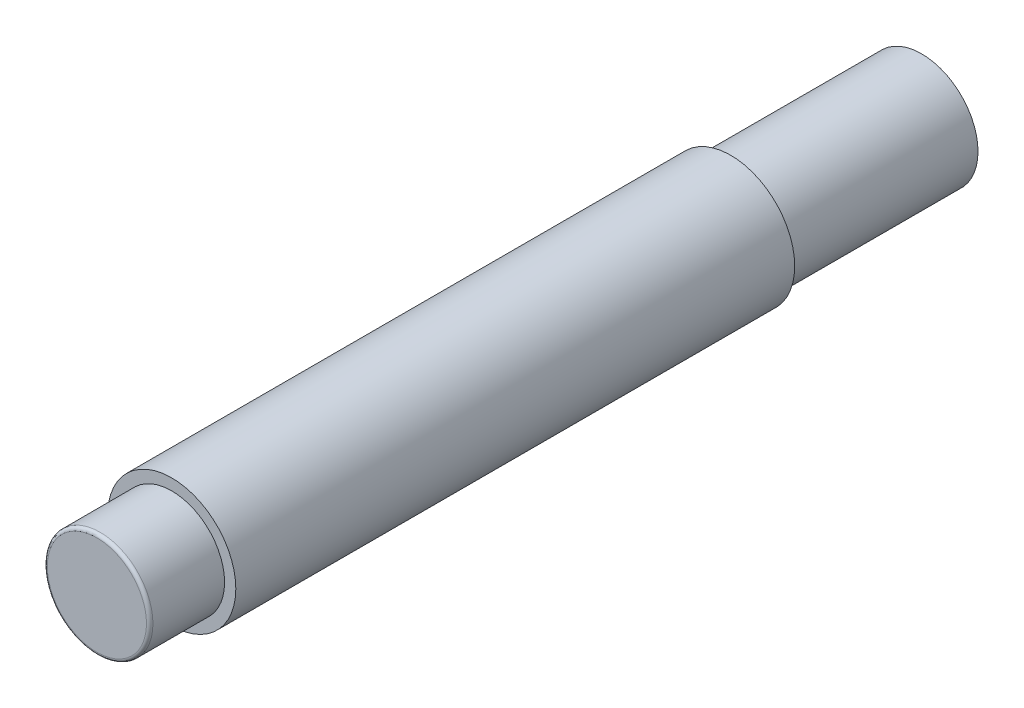
ISO-10303-21;
HEADER;
FILE_DESCRIPTION(('STEP AP214'),'2;1');
FILE_NAME('part.step','',(''),(''),'','','');
FILE_SCHEMA(('AUTOMOTIVE_DESIGN { 1 0 10303 214 1 1 1 1 }'));
ENDSEC;
DATA;
#1=APPLICATION_CONTEXT('core data for automotive mechanical design processes');
#2=APPLICATION_PROTOCOL_DEFINITION('international standard','automotive_design',2000,#1);
#3=PRODUCT_CONTEXT('',#1,'mechanical');
#4=PRODUCT('Part','Part','',(#3));
#5=PRODUCT_RELATED_PRODUCT_CATEGORY('part','',(#4));
#6=PRODUCT_DEFINITION_FORMATION('','',#4);
#7=PRODUCT_DEFINITION_CONTEXT('part definition',#1,'design');
#8=PRODUCT_DEFINITION('design','',#6,#7);
#9=PRODUCT_DEFINITION_SHAPE('','',#8);
#10=(LENGTH_UNIT() NAMED_UNIT(*) SI_UNIT(.MILLI.,.METRE.));
#11=(NAMED_UNIT(*) PLANE_ANGLE_UNIT() SI_UNIT($,.RADIAN.));
#12=(NAMED_UNIT(*) SI_UNIT($,.STERADIAN.) SOLID_ANGLE_UNIT());
#13=UNCERTAINTY_MEASURE_WITH_UNIT(LENGTH_MEASURE(1.E-05),#10,'distance_accuracy_value','');
#14=(GEOMETRIC_REPRESENTATION_CONTEXT(3) GLOBAL_UNCERTAINTY_ASSIGNED_CONTEXT((#13)) GLOBAL_UNIT_ASSIGNED_CONTEXT((#10,
#11,#12)) REPRESENTATION_CONTEXT('',''));
#15=CARTESIAN_POINT('',(0.,0.,0.));
#16=DIRECTION('',(0.,0.,1.));
#17=DIRECTION('',(1.,0.,0.));
#18=AXIS2_PLACEMENT_3D('',#15,#16,#17);
#19=CARTESIAN_POINT('',(0.,0.,0.));
#20=DIRECTION('',(0.,0.,-1.));
#21=DIRECTION('',(-1.,0.,0.));
#22=AXIS2_PLACEMENT_3D('',#19,#20,#21);
#23=PLANE('',#22);
#24=CARTESIAN_POINT('',(0.,0.,0.));
#25=DIRECTION('',(0.,0.,-1.));
#26=DIRECTION('',(-1.,0.,0.));
#27=AXIS2_PLACEMENT_3D('',#24,#25,#26);
#28=CIRCLE('',#27,3.065);
#29=CARTESIAN_POINT('',(-3.065,0.,0.));
#30=VERTEX_POINT('',#29);
#31=EDGE_CURVE('E41',#30,#30,#28,.F.);
#32=ORIENTED_EDGE('',*,*,#31,.T.);
#33=EDGE_LOOP('',(#32));
#34=FACE_BOUND('',#33,.T.);
#35=ADVANCED_FACE('F34',(#34),#23,.F.);
#36=CARTESIAN_POINT('',(0.,0.,22.5914840590574));
#37=DIRECTION('',(0.,0.,1.));
#38=DIRECTION('',(1.,0.,0.));
#39=AXIS2_PLACEMENT_3D('',#36,#37,#38);
#40=CYLINDRICAL_SURFACE('',#39,3.265);
#41=CARTESIAN_POINT('',(0.,0.,-0.199999999999999));
#42=DIRECTION('',(0.,0.,-1.));
#43=DIRECTION('',(-1.,0.,0.));
#44=AXIS2_PLACEMENT_3D('',#41,#42,#43);
#45=CIRCLE('',#44,3.265);
#46=CARTESIAN_POINT('',(-3.265,0.,-0.199999999999999));
#47=VERTEX_POINT('',#46);
#48=EDGE_CURVE('E10',#47,#47,#45,.T.);
#49=ORIENTED_EDGE('',*,*,#48,.T.);
#50=EDGE_LOOP('',(#49));
#51=FACE_BOUND('',#50,.T.);
#52=CARTESIAN_POINT('',(0.,0.,-4.63));
#53=DIRECTION('',(0.,0.,1.));
#54=DIRECTION('',(1.,0.,0.));
#55=AXIS2_PLACEMENT_3D('',#52,#53,#54);
#56=CIRCLE('',#55,3.26499999999999);
#57=CARTESIAN_POINT('',(3.26499999999999,0.,-4.63));
#58=VERTEX_POINT('',#57);
#59=EDGE_CURVE('E45',#58,#58,#56,.T.);
#60=ORIENTED_EDGE('',*,*,#59,.T.);
#61=EDGE_LOOP('',(#60));
#62=FACE_BOUND('',#61,.T.);
#63=ADVANCED_FACE('F78',(#51,#62),#40,.T.);
#64=CARTESIAN_POINT('',(0.,3.26499999999999,-4.63));
#65=DIRECTION('',(0.,0.,-1.));
#66=DIRECTION('',(-1.,0.,0.));
#67=AXIS2_PLACEMENT_3D('',#64,#65,#66);
#68=PLANE('',#67);
#69=ORIENTED_EDGE('',*,*,#59,.F.);
#70=EDGE_LOOP('',(#69));
#71=FACE_BOUND('',#70,.T.);
#72=CARTESIAN_POINT('',(0.,0.,-4.63));
#73=DIRECTION('',(0.,0.,1.));
#74=DIRECTION('',(1.,0.,0.));
#75=AXIS2_PLACEMENT_3D('',#72,#73,#74);
#76=CIRCLE('',#75,3.95999999999999);
#77=CARTESIAN_POINT('',(3.95999999999999,0.,-4.63));
#78=VERTEX_POINT('',#77);
#79=EDGE_CURVE('E49',#78,#78,#76,.T.);
#80=ORIENTED_EDGE('',*,*,#79,.T.);
#81=EDGE_LOOP('',(#80));
#82=FACE_BOUND('',#81,.T.);
#83=ADVANCED_FACE('F82',(#71,#82),#68,.F.);
#84=CARTESIAN_POINT('',(0.,0.,22.5914840590574));
#85=DIRECTION('',(0.,0.,1.));
#86=DIRECTION('',(1.,0.,0.));
#87=AXIS2_PLACEMENT_3D('',#84,#85,#86);
#88=CYLINDRICAL_SURFACE('',#87,3.95999999999999);
#89=ORIENTED_EDGE('',*,*,#79,.F.);
#90=EDGE_LOOP('',(#89));
#91=FACE_BOUND('',#90,.T.);
#92=CARTESIAN_POINT('',(0.,0.,-39.19));
#93=DIRECTION('',(0.,0.,1.));
#94=DIRECTION('',(1.,0.,0.));
#95=AXIS2_PLACEMENT_3D('',#92,#93,#94);
#96=CIRCLE('',#95,3.95999999999999);
#97=CARTESIAN_POINT('',(3.95999999999999,0.,-39.19));
#98=VERTEX_POINT('',#97);
#99=EDGE_CURVE('E54',#98,#98,#96,.T.);
#100=ORIENTED_EDGE('',*,*,#99,.T.);
#101=EDGE_LOOP('',(#100));
#102=FACE_BOUND('',#101,.T.);
#103=ADVANCED_FACE('F87',(#91,#102),#88,.T.);
#104=CARTESIAN_POINT('',(0.,3.95999999999999,-39.19));
#105=DIRECTION('',(0.,0.,1.));
#106=DIRECTION('',(1.,0.,0.));
#107=AXIS2_PLACEMENT_3D('',#104,#105,#106);
#108=PLANE('',#107);
#109=ORIENTED_EDGE('',*,*,#99,.F.);
#110=EDGE_LOOP('',(#109));
#111=FACE_BOUND('',#110,.T.);
#112=CARTESIAN_POINT('',(0.,0.,-39.19));
#113=DIRECTION('',(0.,0.,1.));
#114=DIRECTION('',(1.,0.,0.));
#115=AXIS2_PLACEMENT_3D('',#112,#113,#114);
#116=CIRCLE('',#115,3.485);
#117=CARTESIAN_POINT('',(3.485,0.,-39.19));
#118=VERTEX_POINT('',#117);
#119=EDGE_CURVE('E57',#118,#118,#116,.T.);
#120=ORIENTED_EDGE('',*,*,#119,.T.);
#121=EDGE_LOOP('',(#120));
#122=FACE_BOUND('',#121,.T.);
#123=ADVANCED_FACE('F74',(#111,#122),#108,.F.);
#124=CARTESIAN_POINT('',(0.,0.,22.5914840590574));
#125=DIRECTION('',(0.,0.,1.));
#126=DIRECTION('',(1.,0.,0.));
#127=AXIS2_PLACEMENT_3D('',#124,#125,#126);
#128=CYLINDRICAL_SURFACE('',#127,3.485);
#129=ORIENTED_EDGE('',*,*,#119,.F.);
#130=EDGE_LOOP('',(#129));
#131=FACE_BOUND('',#130,.T.);
#132=CARTESIAN_POINT('',(0.,0.,-51.));
#133=DIRECTION('',(0.,0.,1.));
#134=DIRECTION('',(1.,0.,0.));
#135=AXIS2_PLACEMENT_3D('',#132,#133,#134);
#136=CIRCLE('',#135,3.485);
#137=CARTESIAN_POINT('',(3.485,0.,-51.));
#138=VERTEX_POINT('',#137);
#139=EDGE_CURVE('E60',#138,#138,#136,.T.);
#140=ORIENTED_EDGE('',*,*,#139,.T.);
#141=EDGE_LOOP('',(#140));
#142=FACE_BOUND('',#141,.T.);
#143=ADVANCED_FACE('F64',(#131,#142),#128,.T.);
#144=CARTESIAN_POINT('',(0.,3.485,-51.));
#145=DIRECTION('',(0.,0.,1.));
#146=DIRECTION('',(1.,0.,0.));
#147=AXIS2_PLACEMENT_3D('',#144,#145,#146);
#148=PLANE('',#147);
#149=ORIENTED_EDGE('',*,*,#139,.F.);
#150=EDGE_LOOP('',(#149));
#151=FACE_BOUND('',#150,.T.);
#152=ADVANCED_FACE('F66',(#151),#148,.F.);
#153=CARTESIAN_POINT('',(0.,0.,-0.199999999999999));
#154=DIRECTION('',(0.,0.,-1.));
#155=DIRECTION('',(-1.,0.,0.));
#156=AXIS2_PLACEMENT_3D('',#153,#154,#155);
#157=TOROIDAL_SURFACE('',#156,3.065,0.2);
#158=ORIENTED_EDGE('',*,*,#48,.F.);
#159=EDGE_LOOP('',(#158));
#160=FACE_BOUND('',#159,.T.);
#161=ORIENTED_EDGE('',*,*,#31,.F.);
#162=EDGE_LOOP('',(#161));
#163=FACE_BOUND('',#162,.T.);
#164=ADVANCED_FACE('F36',(#160,#163),#157,.T.);
#165=CLOSED_SHELL('',(#35,#63,#83,#103,#123,#143,#152,#164));
#166=MANIFOLD_SOLID_BREP('B2',#165);
#167=ADVANCED_BREP_SHAPE_REPRESENTATION('',(#18,#166),#14);
#168=SHAPE_DEFINITION_REPRESENTATION(#9,#167);
ENDSEC;
END-ISO-10303-21;
